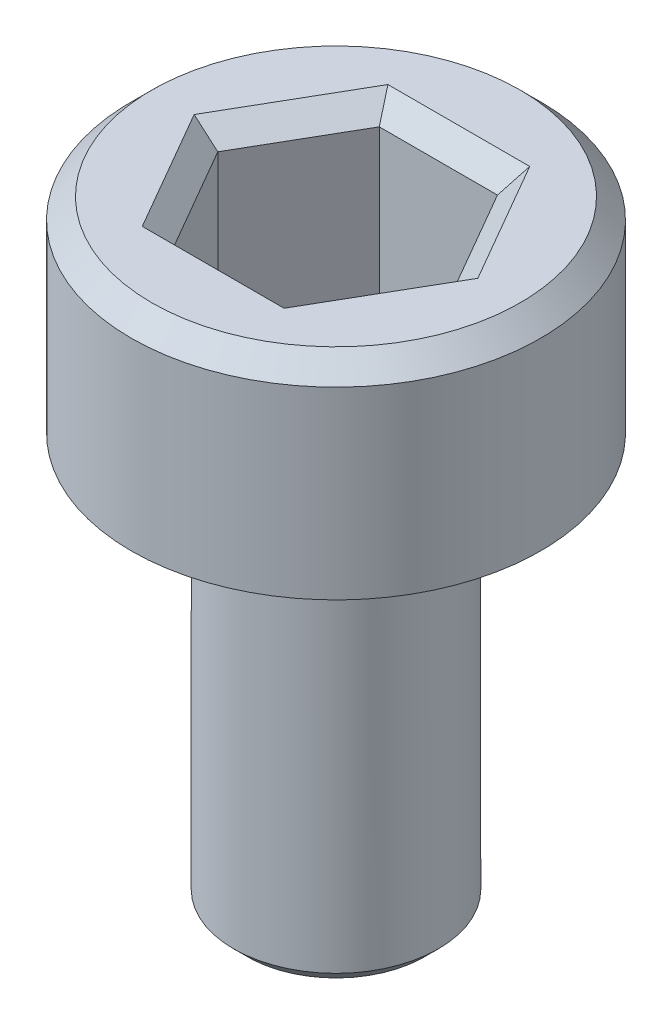
ISO-10303-21;
HEADER;
FILE_DESCRIPTION(('STEP AP214'),'2;1');
FILE_NAME('part.step','',(''),(''),'','','');
FILE_SCHEMA(('AUTOMOTIVE_DESIGN { 1 0 10303 214 1 1 1 1 }'));
ENDSEC;
DATA;
#1=APPLICATION_CONTEXT('core data for automotive mechanical design processes');
#2=APPLICATION_PROTOCOL_DEFINITION('international standard','automotive_design',2000,#1);
#3=PRODUCT_CONTEXT('',#1,'mechanical');
#4=PRODUCT('Part','Part','',(#3));
#5=PRODUCT_RELATED_PRODUCT_CATEGORY('part','',(#4));
#6=PRODUCT_DEFINITION_FORMATION('','',#4);
#7=PRODUCT_DEFINITION_CONTEXT('part definition',#1,'design');
#8=PRODUCT_DEFINITION('design','',#6,#7);
#9=PRODUCT_DEFINITION_SHAPE('','',#8);
#10=(LENGTH_UNIT() NAMED_UNIT(*) SI_UNIT(.MILLI.,.METRE.));
#11=(NAMED_UNIT(*) PLANE_ANGLE_UNIT() SI_UNIT($,.RADIAN.));
#12=(NAMED_UNIT(*) SI_UNIT($,.STERADIAN.) SOLID_ANGLE_UNIT());
#13=UNCERTAINTY_MEASURE_WITH_UNIT(LENGTH_MEASURE(1.E-05),#10,'distance_accuracy_value','');
#14=(GEOMETRIC_REPRESENTATION_CONTEXT(3) GLOBAL_UNCERTAINTY_ASSIGNED_CONTEXT((#13)) GLOBAL_UNIT_ASSIGNED_CONTEXT((#10,
#11,#12)) REPRESENTATION_CONTEXT('',''));
#15=CARTESIAN_POINT('',(0.,0.,0.));
#16=DIRECTION('',(0.,0.,1.));
#17=DIRECTION('',(1.,0.,0.));
#18=AXIS2_PLACEMENT_3D('',#15,#16,#17);
#19=CARTESIAN_POINT('',(0.,0.,0.));
#20=DIRECTION('',(0.,1.,0.));
#21=DIRECTION('',(0.,0.,1.));
#22=AXIS2_PLACEMENT_3D('',#19,#20,#21);
#23=PLANE('',#22);
#24=CARTESIAN_POINT('',(0.,0.,0.));
#25=DIRECTION('',(0.,1.,0.));
#26=DIRECTION('',(0.,0.,1.));
#27=AXIS2_PLACEMENT_3D('',#24,#25,#26);
#28=CIRCLE('',#27,3.);
#29=CARTESIAN_POINT('',(0.,0.,3.));
#30=VERTEX_POINT('',#29);
#31=EDGE_CURVE('E146',#30,#30,#28,.T.);
#32=ORIENTED_EDGE('',*,*,#31,.F.);
#33=EDGE_LOOP('',(#32));
#34=FACE_BOUND('',#33,.T.);
#35=CARTESIAN_POINT('',(0.,0.,0.));
#36=DIRECTION('',(0.,1.,0.));
#37=DIRECTION('',(0.,0.,1.));
#38=AXIS2_PLACEMENT_3D('',#35,#36,#37);
#39=CIRCLE('',#38,1.5);
#40=CARTESIAN_POINT('',(0.,0.,1.5));
#41=VERTEX_POINT('',#40);
#42=EDGE_CURVE('E185',#41,#41,#39,.F.);
#43=ORIENTED_EDGE('',*,*,#42,.F.);
#44=EDGE_LOOP('',(#43));
#45=FACE_BOUND('',#44,.T.);
#46=ADVANCED_FACE('F33',(#34,#45),#23,.F.);
#47=CARTESIAN_POINT('',(0.,3.,0.));
#48=DIRECTION('',(0.,-1.,0.));
#49=DIRECTION('',(0.,0.,-1.));
#50=AXIS2_PLACEMENT_3D('',#47,#48,#49);
#51=CYLINDRICAL_SURFACE('',#50,3.);
#52=CARTESIAN_POINT('',(0.,2.7,0.));
#53=DIRECTION('',(0.,1.,0.));
#54=DIRECTION('',(0.,0.,1.));
#55=AXIS2_PLACEMENT_3D('',#52,#53,#54);
#56=CIRCLE('',#55,3.);
#57=CARTESIAN_POINT('',(0.,2.7,3.));
#58=VERTEX_POINT('',#57);
#59=EDGE_CURVE('E160',#58,#58,#56,.F.);
#60=ORIENTED_EDGE('',*,*,#59,.T.);
#61=EDGE_LOOP('',(#60));
#62=FACE_BOUND('',#61,.T.);
#63=ORIENTED_EDGE('',*,*,#31,.T.);
#64=EDGE_LOOP('',(#63));
#65=FACE_BOUND('',#64,.T.);
#66=ADVANCED_FACE('F213',(#62,#65),#51,.T.);
#67=CARTESIAN_POINT('',(0.,3.,0.));
#68=DIRECTION('',(0.,1.,0.));
#69=DIRECTION('',(0.,0.,1.));
#70=AXIS2_PLACEMENT_3D('',#67,#68,#69);
#71=PLANE('',#70);
#72=DIRECTION('',(1.,0.,0.));
#73=VECTOR('',#72,1.);
#74=CARTESIAN_POINT('',(0.866025403784439,3.,-1.8));
#75=LINE('',#74,#73);
#76=CARTESIAN_POINT('',(-1.03923048454133,3.,-1.8));
#77=VERTEX_POINT('',#76);
#78=CARTESIAN_POINT('',(1.03923048454133,3.,-1.8));
#79=VERTEX_POINT('',#78);
#80=EDGE_CURVE('E165',#77,#79,#75,.T.);
#81=ORIENTED_EDGE('',*,*,#80,.T.);
#82=DIRECTION('',(0.5,0.,0.866025403784439));
#83=VECTOR('',#82,1.);
#84=CARTESIAN_POINT('',(1.99185842870421,3.,-0.150000000000001));
#85=LINE('',#84,#83);
#86=CARTESIAN_POINT('',(2.07846096908265,3.,0.));
#87=VERTEX_POINT('',#86);
#88=EDGE_CURVE('E175',#79,#87,#85,.T.);
#89=ORIENTED_EDGE('',*,*,#88,.T.);
#90=DIRECTION('',(-0.5,0.,0.866025403784439));
#91=VECTOR('',#90,1.);
#92=CARTESIAN_POINT('',(1.12583302491977,3.,1.65));
#93=LINE('',#92,#91);
#94=CARTESIAN_POINT('',(1.03923048454133,3.,1.8));
#95=VERTEX_POINT('',#94);
#96=EDGE_CURVE('E173',#87,#95,#93,.T.);
#97=ORIENTED_EDGE('',*,*,#96,.T.);
#98=DIRECTION('',(-1.,0.,0.));
#99=VECTOR('',#98,1.);
#100=CARTESIAN_POINT('',(-0.866025403784438,3.,1.8));
#101=LINE('',#100,#99);
#102=CARTESIAN_POINT('',(-1.03923048454133,3.,1.8));
#103=VERTEX_POINT('',#102);
#104=EDGE_CURVE('E171',#95,#103,#101,.T.);
#105=ORIENTED_EDGE('',*,*,#104,.T.);
#106=DIRECTION('',(-0.5,0.,-0.866025403784439));
#107=VECTOR('',#106,1.);
#108=CARTESIAN_POINT('',(-1.99185842870421,3.,0.150000000000001));
#109=LINE('',#108,#107);
#110=CARTESIAN_POINT('',(-2.07846096908265,3.,0.));
#111=VERTEX_POINT('',#110);
#112=EDGE_CURVE('E169',#103,#111,#109,.T.);
#113=ORIENTED_EDGE('',*,*,#112,.T.);
#114=DIRECTION('',(0.5,0.,-0.866025403784439));
#115=VECTOR('',#114,1.);
#116=CARTESIAN_POINT('',(-1.12583302491977,3.,-1.65));
#117=LINE('',#116,#115);
#118=EDGE_CURVE('E167',#111,#77,#117,.T.);
#119=ORIENTED_EDGE('',*,*,#118,.T.);
#120=EDGE_LOOP('',(#81,#89,#97,#105,#113,#119));
#121=FACE_BOUND('',#120,.T.);
#122=CARTESIAN_POINT('',(0.,3.,0.));
#123=DIRECTION('',(0.,1.,0.));
#124=DIRECTION('',(0.,0.,1.));
#125=AXIS2_PLACEMENT_3D('',#122,#123,#124);
#126=CIRCLE('',#125,2.7);
#127=CARTESIAN_POINT('',(0.,3.,2.7));
#128=VERTEX_POINT('',#127);
#129=EDGE_CURVE('E157',#128,#128,#126,.T.);
#130=ORIENTED_EDGE('',*,*,#129,.T.);
#131=EDGE_LOOP('',(#130));
#132=FACE_BOUND('',#131,.T.);
#133=ADVANCED_FACE('F219',(#121,#132),#71,.T.);
#134=CARTESIAN_POINT('',(0.,3.,0.));
#135=DIRECTION('',(0.,-1.,0.));
#136=DIRECTION('',(0.,0.,-1.));
#137=AXIS2_PLACEMENT_3D('',#134,#135,#136);
#138=CONICAL_SURFACE('',#137,2.7,0.785398163397448);
#139=ORIENTED_EDGE('',*,*,#59,.F.);
#140=EDGE_LOOP('',(#139));
#141=FACE_BOUND('',#140,.T.);
#142=ORIENTED_EDGE('',*,*,#129,.F.);
#143=EDGE_LOOP('',(#142));
#144=FACE_BOUND('',#143,.T.);
#145=ADVANCED_FACE('F227',(#141,#144),#138,.T.);
#146=CARTESIAN_POINT('',(0.866025403784439,0.5,1.5));
#147=DIRECTION('',(0.866025403784439,0.,0.5));
#148=DIRECTION('',(0.5,0.,-0.866025403784439));
#149=AXIS2_PLACEMENT_3D('',#146,#147,#148);
#150=PLANE('',#149);
#151=DIRECTION('',(0.,1.,0.));
#152=VECTOR('',#151,1.);
#153=CARTESIAN_POINT('',(0.866025403784439,0.5,1.5));
#154=LINE('',#153,#152);
#155=CARTESIAN_POINT('',(0.866025403784439,0.5,1.5));
#156=VERTEX_POINT('',#155);
#157=CARTESIAN_POINT('',(0.866025403784439,2.7,1.5));
#158=VERTEX_POINT('',#157);
#159=EDGE_CURVE('E144',#156,#158,#154,.T.);
#160=ORIENTED_EDGE('',*,*,#159,.T.);
#161=DIRECTION('',(0.5,0.,-0.866025403784439));
#162=VECTOR('',#161,1.);
#163=CARTESIAN_POINT('',(1.73205080756888,2.7,0.));
#164=LINE('',#163,#162);
#165=CARTESIAN_POINT('',(1.73205080756888,2.7,0.));
#166=VERTEX_POINT('',#165);
#167=EDGE_CURVE('E113',#158,#166,#164,.T.);
#168=ORIENTED_EDGE('',*,*,#167,.T.);
#169=DIRECTION('',(0.,1.,0.));
#170=VECTOR('',#169,1.);
#171=CARTESIAN_POINT('',(1.73205080756888,0.5,0.));
#172=LINE('',#171,#170);
#173=CARTESIAN_POINT('',(1.73205080756888,0.5,0.));
#174=VERTEX_POINT('',#173);
#175=EDGE_CURVE('E105',#174,#166,#172,.T.);
#176=ORIENTED_EDGE('',*,*,#175,.F.);
#177=DIRECTION('',(0.5,0.,-0.866025403784439));
#178=VECTOR('',#177,1.);
#179=CARTESIAN_POINT('',(0.866025403784439,0.5,1.5));
#180=LINE('',#179,#178);
#181=EDGE_CURVE('E110',#156,#174,#180,.T.);
#182=ORIENTED_EDGE('',*,*,#181,.F.);
#183=EDGE_LOOP('',(#160,#168,#176,#182));
#184=FACE_BOUND('',#183,.T.);
#185=ADVANCED_FACE('F108',(#184),#150,.F.);
#186=CARTESIAN_POINT('',(-0.866025403784438,0.5,1.5));
#187=DIRECTION('',(0.,0.,1.));
#188=DIRECTION('',(1.,0.,0.));
#189=AXIS2_PLACEMENT_3D('',#186,#187,#188);
#190=PLANE('',#189);
#191=DIRECTION('',(0.,1.,0.));
#192=VECTOR('',#191,1.);
#193=CARTESIAN_POINT('',(-0.866025403784438,0.5,1.5));
#194=LINE('',#193,#192);
#195=CARTESIAN_POINT('',(-0.866025403784438,0.5,1.5));
#196=VERTEX_POINT('',#195);
#197=CARTESIAN_POINT('',(-0.866025403784438,2.7,1.5));
#198=VERTEX_POINT('',#197);
#199=EDGE_CURVE('E147',#196,#198,#194,.T.);
#200=ORIENTED_EDGE('',*,*,#199,.T.);
#201=DIRECTION('',(1.,0.,0.));
#202=VECTOR('',#201,1.);
#203=CARTESIAN_POINT('',(0.866025403784439,2.7,1.5));
#204=LINE('',#203,#202);
#205=EDGE_CURVE('E179',#198,#158,#204,.T.);
#206=ORIENTED_EDGE('',*,*,#205,.T.);
#207=ORIENTED_EDGE('',*,*,#159,.F.);
#208=DIRECTION('',(1.,0.,0.));
#209=VECTOR('',#208,1.);
#210=CARTESIAN_POINT('',(-0.866025403784438,0.5,1.5));
#211=LINE('',#210,#209);
#212=EDGE_CURVE('E118',#196,#156,#211,.T.);
#213=ORIENTED_EDGE('',*,*,#212,.F.);
#214=EDGE_LOOP('',(#200,#206,#207,#213));
#215=FACE_BOUND('',#214,.T.);
#216=ADVANCED_FACE('F280',(#215),#190,.F.);
#217=CARTESIAN_POINT('',(-1.73205080756888,0.5,0.));
#218=DIRECTION('',(-0.866025403784438,0.,0.5));
#219=DIRECTION('',(0.5,0.,0.866025403784439));
#220=AXIS2_PLACEMENT_3D('',#217,#218,#219);
#221=PLANE('',#220);
#222=DIRECTION('',(0.,1.,0.));
#223=VECTOR('',#222,1.);
#224=CARTESIAN_POINT('',(-1.73205080756888,0.5,0.));
#225=LINE('',#224,#223);
#226=CARTESIAN_POINT('',(-1.73205080756888,0.5,0.));
#227=VERTEX_POINT('',#226);
#228=CARTESIAN_POINT('',(-1.73205080756888,2.7,0.));
#229=VERTEX_POINT('',#228);
#230=EDGE_CURVE('E150',#227,#229,#225,.T.);
#231=ORIENTED_EDGE('',*,*,#230,.T.);
#232=DIRECTION('',(0.5,0.,0.866025403784439));
#233=VECTOR('',#232,1.);
#234=CARTESIAN_POINT('',(-0.866025403784438,2.7,1.5));
#235=LINE('',#234,#233);
#236=EDGE_CURVE('E181',#229,#198,#235,.T.);
#237=ORIENTED_EDGE('',*,*,#236,.T.);
#238=ORIENTED_EDGE('',*,*,#199,.F.);
#239=DIRECTION('',(0.5,0.,0.866025403784439));
#240=VECTOR('',#239,1.);
#241=CARTESIAN_POINT('',(-1.73205080756888,0.5,0.));
#242=LINE('',#241,#240);
#243=EDGE_CURVE('E141',#227,#196,#242,.T.);
#244=ORIENTED_EDGE('',*,*,#243,.F.);
#245=EDGE_LOOP('',(#231,#237,#238,#244));
#246=FACE_BOUND('',#245,.T.);
#247=ADVANCED_FACE('F278',(#246),#221,.F.);
#248=CARTESIAN_POINT('',(-0.866025403784438,0.5,-1.5));
#249=DIRECTION('',(-0.866025403784439,0.,-0.5));
#250=DIRECTION('',(-0.5,0.,0.866025403784439));
#251=AXIS2_PLACEMENT_3D('',#248,#249,#250);
#252=PLANE('',#251);
#253=DIRECTION('',(0.,1.,0.));
#254=VECTOR('',#253,1.);
#255=CARTESIAN_POINT('',(-0.866025403784438,0.5,-1.5));
#256=LINE('',#255,#254);
#257=CARTESIAN_POINT('',(-0.866025403784438,0.5,-1.5));
#258=VERTEX_POINT('',#257);
#259=CARTESIAN_POINT('',(-0.866025403784438,2.7,-1.5));
#260=VERTEX_POINT('',#259);
#261=EDGE_CURVE('E152',#258,#260,#256,.T.);
#262=ORIENTED_EDGE('',*,*,#261,.T.);
#263=DIRECTION('',(-0.5,0.,0.866025403784439));
#264=VECTOR('',#263,1.);
#265=CARTESIAN_POINT('',(-1.73205080756888,2.7,0.));
#266=LINE('',#265,#264);
#267=EDGE_CURVE('E55',#260,#229,#266,.T.);
#268=ORIENTED_EDGE('',*,*,#267,.T.);
#269=ORIENTED_EDGE('',*,*,#230,.F.);
#270=DIRECTION('',(-0.5,0.,0.866025403784439));
#271=VECTOR('',#270,1.);
#272=CARTESIAN_POINT('',(-0.866025403784438,0.5,-1.5));
#273=LINE('',#272,#271);
#274=EDGE_CURVE('E138',#258,#227,#273,.T.);
#275=ORIENTED_EDGE('',*,*,#274,.F.);
#276=EDGE_LOOP('',(#262,#268,#269,#275));
#277=FACE_BOUND('',#276,.T.);
#278=ADVANCED_FACE('F276',(#277),#252,.F.);
#279=CARTESIAN_POINT('',(0.866025403784439,0.5,-1.5));
#280=DIRECTION('',(0.,0.,-1.));
#281=DIRECTION('',(-1.,0.,0.));
#282=AXIS2_PLACEMENT_3D('',#279,#280,#281);
#283=PLANE('',#282);
#284=DIRECTION('',(0.,1.,0.));
#285=VECTOR('',#284,1.);
#286=CARTESIAN_POINT('',(0.866025403784439,0.5,-1.5));
#287=LINE('',#286,#285);
#288=CARTESIAN_POINT('',(0.866025403784439,0.5,-1.5));
#289=VERTEX_POINT('',#288);
#290=CARTESIAN_POINT('',(0.866025403784439,2.7,-1.5));
#291=VERTEX_POINT('',#290);
#292=EDGE_CURVE('E117',#289,#291,#287,.T.);
#293=ORIENTED_EDGE('',*,*,#292,.T.);
#294=DIRECTION('',(-1.,0.,0.));
#295=VECTOR('',#294,1.);
#296=CARTESIAN_POINT('',(-0.866025403784438,2.7,-1.5));
#297=LINE('',#296,#295);
#298=EDGE_CURVE('E48',#291,#260,#297,.T.);
#299=ORIENTED_EDGE('',*,*,#298,.T.);
#300=ORIENTED_EDGE('',*,*,#261,.F.);
#301=DIRECTION('',(-1.,0.,0.));
#302=VECTOR('',#301,1.);
#303=CARTESIAN_POINT('',(0.866025403784439,0.5,-1.5));
#304=LINE('',#303,#302);
#305=EDGE_CURVE('E126',#289,#258,#304,.T.);
#306=ORIENTED_EDGE('',*,*,#305,.F.);
#307=EDGE_LOOP('',(#293,#299,#300,#306));
#308=FACE_BOUND('',#307,.T.);
#309=ADVANCED_FACE('F273',(#308),#283,.F.);
#310=CARTESIAN_POINT('',(1.73205080756888,0.5,0.));
#311=DIRECTION('',(0.866025403784438,0.,-0.5));
#312=DIRECTION('',(-0.5,0.,-0.866025403784438));
#313=AXIS2_PLACEMENT_3D('',#310,#311,#312);
#314=PLANE('',#313);
#315=ORIENTED_EDGE('',*,*,#175,.T.);
#316=DIRECTION('',(-0.5,0.,-0.866025403784438));
#317=VECTOR('',#316,1.);
#318=CARTESIAN_POINT('',(0.866025403784439,2.7,-1.5));
#319=LINE('',#318,#317);
#320=EDGE_CURVE('E163',#166,#291,#319,.T.);
#321=ORIENTED_EDGE('',*,*,#320,.T.);
#322=ORIENTED_EDGE('',*,*,#292,.F.);
#323=DIRECTION('',(-0.5,0.,-0.866025403784438));
#324=VECTOR('',#323,1.);
#325=CARTESIAN_POINT('',(1.73205080756888,0.5,0.));
#326=LINE('',#325,#324);
#327=EDGE_CURVE('E121',#174,#289,#326,.T.);
#328=ORIENTED_EDGE('',*,*,#327,.F.);
#329=EDGE_LOOP('',(#315,#321,#322,#328));
#330=FACE_BOUND('',#329,.T.);
#331=ADVANCED_FACE('F122',(#330),#314,.F.);
#332=CARTESIAN_POINT('',(0.,0.5,0.));
#333=DIRECTION('',(0.,1.,0.));
#334=DIRECTION('',(0.,0.,1.));
#335=AXIS2_PLACEMENT_3D('',#332,#333,#334);
#336=PLANE('',#335);
#337=ORIENTED_EDGE('',*,*,#181,.T.);
#338=ORIENTED_EDGE('',*,*,#327,.T.);
#339=ORIENTED_EDGE('',*,*,#305,.T.);
#340=ORIENTED_EDGE('',*,*,#274,.T.);
#341=ORIENTED_EDGE('',*,*,#243,.T.);
#342=ORIENTED_EDGE('',*,*,#212,.T.);
#343=EDGE_LOOP('',(#337,#338,#339,#340,#341,#342));
#344=FACE_BOUND('',#343,.T.);
#345=ADVANCED_FACE('F128',(#344),#336,.T.);
#346=CARTESIAN_POINT('',(-1.73205080756888,2.7,0.));
#347=DIRECTION('',(0.612372435695794,0.707106781186548,-0.353553390593273));
#348=DIRECTION('',(-0.5,0.,-0.866025403784439));
#349=AXIS2_PLACEMENT_3D('',#346,#347,#348);
#350=PLANE('',#349);
#351=DIRECTION('',(0.755928946018455,-0.654653670707976,0.));
#352=VECTOR('',#351,1.);
#353=CARTESIAN_POINT('',(-1.73205080756888,2.7,0.));
#354=LINE('',#353,#352);
#355=EDGE_CURVE('E134',#111,#229,#354,.T.);
#356=ORIENTED_EDGE('',*,*,#355,.F.);
#357=ORIENTED_EDGE('',*,*,#112,.F.);
#358=DIRECTION('',(0.377964473009228,-0.654653670707976,-0.654653670707978));
#359=VECTOR('',#358,1.);
#360=CARTESIAN_POINT('',(-0.866025403784438,2.7,1.5));
#361=LINE('',#360,#359);
#362=EDGE_CURVE('E131',#198,#103,#361,.F.);
#363=ORIENTED_EDGE('',*,*,#362,.F.);
#364=ORIENTED_EDGE('',*,*,#236,.F.);
#365=EDGE_LOOP('',(#356,#357,#363,#364));
#366=FACE_BOUND('',#365,.T.);
#367=ADVANCED_FACE('F249',(#366),#350,.T.);
#368=CARTESIAN_POINT('',(-0.866025403784438,2.7,1.5));
#369=DIRECTION('',(0.,0.707106781186548,-0.707106781186547));
#370=DIRECTION('',(-1.,0.,0.));
#371=AXIS2_PLACEMENT_3D('',#368,#369,#370);
#372=PLANE('',#371);
#373=ORIENTED_EDGE('',*,*,#362,.T.);
#374=ORIENTED_EDGE('',*,*,#104,.F.);
#375=DIRECTION('',(-0.377964473009228,-0.654653670707976,-0.654653670707978));
#376=VECTOR('',#375,1.);
#377=CARTESIAN_POINT('',(0.866025403784439,2.7,1.5));
#378=LINE('',#377,#376);
#379=EDGE_CURVE('E193',#158,#95,#378,.F.);
#380=ORIENTED_EDGE('',*,*,#379,.F.);
#381=ORIENTED_EDGE('',*,*,#205,.F.);
#382=EDGE_LOOP('',(#373,#374,#380,#381));
#383=FACE_BOUND('',#382,.T.);
#384=ADVANCED_FACE('F246',(#383),#372,.T.);
#385=CARTESIAN_POINT('',(-0.866025403784438,2.7,-1.5));
#386=DIRECTION('',(0.612372435695794,0.707106781186549,0.353553390593273));
#387=DIRECTION('',(0.5,0.,-0.866025403784439));
#388=AXIS2_PLACEMENT_3D('',#385,#386,#387);
#389=PLANE('',#388);
#390=ORIENTED_EDGE('',*,*,#355,.T.);
#391=ORIENTED_EDGE('',*,*,#267,.F.);
#392=DIRECTION('',(0.377964473009228,-0.654653670707976,0.654653670707978));
#393=VECTOR('',#392,1.);
#394=CARTESIAN_POINT('',(-0.866025403784438,2.7,-1.5));
#395=LINE('',#394,#393);
#396=EDGE_CURVE('E190',#77,#260,#395,.T.);
#397=ORIENTED_EDGE('',*,*,#396,.F.);
#398=ORIENTED_EDGE('',*,*,#118,.F.);
#399=EDGE_LOOP('',(#390,#391,#397,#398));
#400=FACE_BOUND('',#399,.T.);
#401=ADVANCED_FACE('F242',(#400),#389,.T.);
#402=CARTESIAN_POINT('',(0.866025403784439,2.7,1.5));
#403=DIRECTION('',(-0.612372435695794,0.707106781186549,-0.353553390593273));
#404=DIRECTION('',(-0.5,0.,0.866025403784439));
#405=AXIS2_PLACEMENT_3D('',#402,#403,#404);
#406=PLANE('',#405);
#407=ORIENTED_EDGE('',*,*,#379,.T.);
#408=ORIENTED_EDGE('',*,*,#96,.F.);
#409=DIRECTION('',(-0.755928946018455,-0.654653670707976,0.));
#410=VECTOR('',#409,1.);
#411=CARTESIAN_POINT('',(1.73205080756888,2.7,0.));
#412=LINE('',#411,#410);
#413=EDGE_CURVE('E188',#166,#87,#412,.F.);
#414=ORIENTED_EDGE('',*,*,#413,.F.);
#415=ORIENTED_EDGE('',*,*,#167,.F.);
#416=EDGE_LOOP('',(#407,#408,#414,#415));
#417=FACE_BOUND('',#416,.T.);
#418=ADVANCED_FACE('F238',(#417),#406,.T.);
#419=CARTESIAN_POINT('',(0.866025403784439,2.7,-1.5));
#420=DIRECTION('',(0.,0.707106781186549,0.707106781186547));
#421=DIRECTION('',(1.,0.,0.));
#422=AXIS2_PLACEMENT_3D('',#419,#420,#421);
#423=PLANE('',#422);
#424=ORIENTED_EDGE('',*,*,#396,.T.);
#425=ORIENTED_EDGE('',*,*,#298,.F.);
#426=DIRECTION('',(0.377964473009228,0.654653670707976,-0.654653670707978));
#427=VECTOR('',#426,1.);
#428=CARTESIAN_POINT('',(0.618589574131741,2.27142857142857,-1.07142857142857));
#429=LINE('',#428,#427);
#430=EDGE_CURVE('E186',#79,#291,#429,.F.);
#431=ORIENTED_EDGE('',*,*,#430,.F.);
#432=ORIENTED_EDGE('',*,*,#80,.F.);
#433=EDGE_LOOP('',(#424,#425,#431,#432));
#434=FACE_BOUND('',#433,.T.);
#435=ADVANCED_FACE('F234',(#434),#423,.T.);
#436=CARTESIAN_POINT('',(1.73205080756888,2.7,0.));
#437=DIRECTION('',(-0.612372435695793,0.707106781186549,0.353553390593273));
#438=DIRECTION('',(0.5,0.,0.866025403784438));
#439=AXIS2_PLACEMENT_3D('',#436,#437,#438);
#440=PLANE('',#439);
#441=ORIENTED_EDGE('',*,*,#413,.T.);
#442=ORIENTED_EDGE('',*,*,#88,.F.);
#443=ORIENTED_EDGE('',*,*,#430,.T.);
#444=ORIENTED_EDGE('',*,*,#320,.F.);
#445=EDGE_LOOP('',(#441,#442,#443,#444));
#446=FACE_BOUND('',#445,.T.);
#447=ADVANCED_FACE('F231',(#446),#440,.T.);
#448=CARTESIAN_POINT('',(0.,-6.,0.));
#449=DIRECTION('',(0.,1.,0.));
#450=DIRECTION('',(0.,0.,1.));
#451=AXIS2_PLACEMENT_3D('',#448,#449,#450);
#452=CYLINDRICAL_SURFACE('',#451,1.5);
#453=CARTESIAN_POINT('',(0.,-5.8,0.));
#454=DIRECTION('',(0.,-1.,0.));
#455=DIRECTION('',(0.,0.,-1.));
#456=AXIS2_PLACEMENT_3D('',#453,#454,#455);
#457=CIRCLE('',#456,1.5);
#458=CARTESIAN_POINT('',(0.,-5.8,-1.5));
#459=VERTEX_POINT('',#458);
#460=EDGE_CURVE('E11',#459,#459,#457,.F.);
#461=ORIENTED_EDGE('',*,*,#460,.T.);
#462=EDGE_LOOP('',(#461));
#463=FACE_BOUND('',#462,.T.);
#464=ORIENTED_EDGE('',*,*,#42,.T.);
#465=EDGE_LOOP('',(#464));
#466=FACE_BOUND('',#465,.T.);
#467=ADVANCED_FACE('F209',(#463,#466),#452,.T.);
#468=CARTESIAN_POINT('',(0.,-6.,0.));
#469=DIRECTION('',(0.,-1.,0.));
#470=DIRECTION('',(0.,0.,-1.));
#471=AXIS2_PLACEMENT_3D('',#468,#469,#470);
#472=PLANE('',#471);
#473=CARTESIAN_POINT('',(0.,-6.,0.));
#474=DIRECTION('',(0.,-1.,0.));
#475=DIRECTION('',(0.,0.,-1.));
#476=AXIS2_PLACEMENT_3D('',#473,#474,#475);
#477=CIRCLE('',#476,1.3);
#478=CARTESIAN_POINT('',(0.,-6.,-1.3));
#479=VERTEX_POINT('',#478);
#480=EDGE_CURVE('E41',#479,#479,#477,.T.);
#481=ORIENTED_EDGE('',*,*,#480,.T.);
#482=EDGE_LOOP('',(#481));
#483=FACE_BOUND('',#482,.T.);
#484=ADVANCED_FACE('F202',(#483),#472,.T.);
#485=CARTESIAN_POINT('',(0.,-6.,0.));
#486=DIRECTION('',(0.,1.,0.));
#487=DIRECTION('',(0.,0.,1.));
#488=AXIS2_PLACEMENT_3D('',#485,#486,#487);
#489=CONICAL_SURFACE('',#488,1.3,0.78539816339745);
#490=ORIENTED_EDGE('',*,*,#460,.F.);
#491=EDGE_LOOP('',(#490));
#492=FACE_BOUND('',#491,.T.);
#493=ORIENTED_EDGE('',*,*,#480,.F.);
#494=EDGE_LOOP('',(#493));
#495=FACE_BOUND('',#494,.T.);
#496=ADVANCED_FACE('F35',(#492,#495),#489,.T.);
#497=CLOSED_SHELL('',(#46,#66,#133,#145,#185,#216,#247,#278,#309,#331,#345,#367,#384,#401,#418,
#435,#447,#467,#484,#496));
#498=MANIFOLD_SOLID_BREP('B2',#497);
#499=ADVANCED_BREP_SHAPE_REPRESENTATION('',(#18,#498),#14);
#500=SHAPE_DEFINITION_REPRESENTATION(#9,#499);
ENDSEC;
END-ISO-10303-21;
